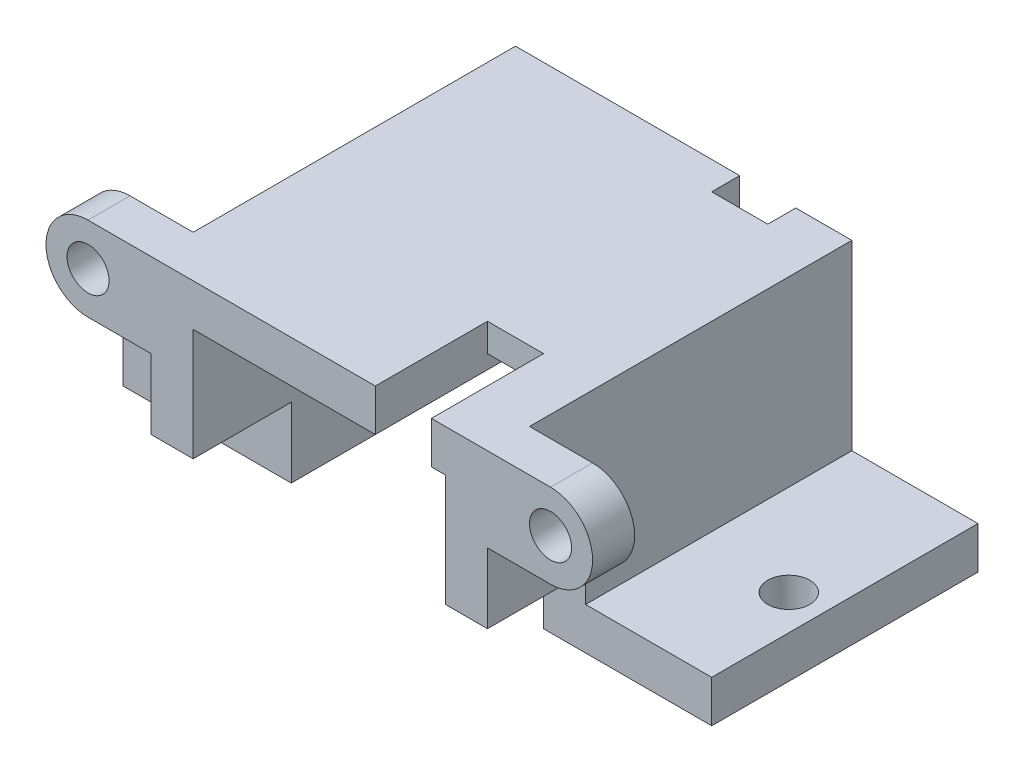
ISO-10303-21;
HEADER;
FILE_DESCRIPTION(('STEP AP214'),'2;1');
FILE_NAME('part.step','',(''),(''),'','','');
FILE_SCHEMA(('AUTOMOTIVE_DESIGN { 1 0 10303 214 1 1 1 1 }'));
ENDSEC;
DATA;
#1=APPLICATION_CONTEXT('core data for automotive mechanical design processes');
#2=APPLICATION_PROTOCOL_DEFINITION('international standard','automotive_design',2000,#1);
#3=PRODUCT_CONTEXT('',#1,'mechanical');
#4=PRODUCT('Part','Part','',(#3));
#5=PRODUCT_RELATED_PRODUCT_CATEGORY('part','',(#4));
#6=PRODUCT_DEFINITION_FORMATION('','',#4);
#7=PRODUCT_DEFINITION_CONTEXT('part definition',#1,'design');
#8=PRODUCT_DEFINITION('design','',#6,#7);
#9=PRODUCT_DEFINITION_SHAPE('','',#8);
#10=(LENGTH_UNIT() NAMED_UNIT(*) SI_UNIT(.MILLI.,.METRE.));
#11=(NAMED_UNIT(*) PLANE_ANGLE_UNIT() SI_UNIT($,.RADIAN.));
#12=(NAMED_UNIT(*) SI_UNIT($,.STERADIAN.) SOLID_ANGLE_UNIT());
#13=UNCERTAINTY_MEASURE_WITH_UNIT(LENGTH_MEASURE(1.E-05),#10,'distance_accuracy_value','');
#14=(GEOMETRIC_REPRESENTATION_CONTEXT(3) GLOBAL_UNCERTAINTY_ASSIGNED_CONTEXT((#13)) GLOBAL_UNIT_ASSIGNED_CONTEXT((#10,
#11,#12)) REPRESENTATION_CONTEXT('',''));
#15=CARTESIAN_POINT('',(0.,0.,0.));
#16=DIRECTION('',(0.,0.,1.));
#17=DIRECTION('',(1.,0.,0.));
#18=AXIS2_PLACEMENT_3D('',#15,#16,#17);
#19=CARTESIAN_POINT('',(-9.,13.,13.));
#20=DIRECTION('',(0.,1.,0.));
#21=DIRECTION('',(0.,0.,1.));
#22=AXIS2_PLACEMENT_3D('',#19,#20,#21);
#23=PLANE('',#22);
#24=DIRECTION('',(0.,0.,1.));
#25=VECTOR('',#24,1.);
#26=CARTESIAN_POINT('',(8.,13.,13.));
#27=LINE('',#26,#25);
#28=CARTESIAN_POINT('',(8.,13.,-13.));
#29=VERTEX_POINT('',#28);
#30=CARTESIAN_POINT('',(8.,13.,13.));
#31=VERTEX_POINT('',#30);
#32=EDGE_CURVE('E481',#29,#31,#27,.T.);
#33=ORIENTED_EDGE('',*,*,#32,.F.);
#34=DIRECTION('',(1.,0.,0.));
#35=VECTOR('',#34,1.);
#36=CARTESIAN_POINT('',(-9.,13.,-13.));
#37=LINE('',#36,#35);
#38=CARTESIAN_POINT('',(9.,13.,-13.));
#39=VERTEX_POINT('',#38);
#40=EDGE_CURVE('E373',#29,#39,#37,.T.);
#41=ORIENTED_EDGE('',*,*,#40,.T.);
#42=DIRECTION('',(0.,0.,-1.));
#43=VECTOR('',#42,1.);
#44=CARTESIAN_POINT('',(9.,13.,13.));
#45=LINE('',#44,#43);
#46=CARTESIAN_POINT('',(9.,13.,13.));
#47=VERTEX_POINT('',#46);
#48=EDGE_CURVE('E380',#47,#39,#45,.T.);
#49=ORIENTED_EDGE('',*,*,#48,.F.);
#50=DIRECTION('',(1.,0.,0.));
#51=VECTOR('',#50,1.);
#52=CARTESIAN_POINT('',(-9.,13.,13.));
#53=LINE('',#52,#51);
#54=EDGE_CURVE('E336',#31,#47,#53,.T.);
#55=ORIENTED_EDGE('',*,*,#54,.F.);
#56=EDGE_LOOP('',(#33,#41,#49,#55));
#57=FACE_BOUND('',#56,.T.);
#58=ADVANCED_FACE('F37',(#57),#23,.F.);
#59=CARTESIAN_POINT('',(-21.,3.,13.));
#60=DIRECTION('',(0.,1.,0.));
#61=DIRECTION('',(0.,0.,1.));
#62=AXIS2_PLACEMENT_3D('',#59,#60,#61);
#63=PLANE('',#62);
#64=DIRECTION('',(-1.,0.,0.));
#65=VECTOR('',#64,1.);
#66=CARTESIAN_POINT('',(-21.,3.,6.));
#67=LINE('',#66,#65);
#68=CARTESIAN_POINT('',(-12.,3.,6.));
#69=VERTEX_POINT('',#68);
#70=CARTESIAN_POINT('',(-21.,3.,6.));
#71=VERTEX_POINT('',#70);
#72=EDGE_CURVE('E455',#69,#71,#67,.T.);
#73=ORIENTED_EDGE('',*,*,#72,.F.);
#74=DIRECTION('',(0.,0.,-1.));
#75=VECTOR('',#74,1.);
#76=CARTESIAN_POINT('',(-12.,3.,13.));
#77=LINE('',#76,#75);
#78=CARTESIAN_POINT('',(-12.,3.,-13.));
#79=VERTEX_POINT('',#78);
#80=EDGE_CURVE('E392',#69,#79,#77,.T.);
#81=ORIENTED_EDGE('',*,*,#80,.T.);
#82=DIRECTION('',(1.,0.,0.));
#83=VECTOR('',#82,1.);
#84=CARTESIAN_POINT('',(-21.,3.,-13.));
#85=LINE('',#84,#83);
#86=CARTESIAN_POINT('',(-21.,3.,-13.));
#87=VERTEX_POINT('',#86);
#88=EDGE_CURVE('E362',#87,#79,#85,.T.);
#89=ORIENTED_EDGE('',*,*,#88,.F.);
#90=DIRECTION('',(0.,0.,-1.));
#91=VECTOR('',#90,1.);
#92=CARTESIAN_POINT('',(-21.,3.,13.));
#93=LINE('',#92,#91);
#94=EDGE_CURVE('E390',#71,#87,#93,.T.);
#95=ORIENTED_EDGE('',*,*,#94,.F.);
#96=EDGE_LOOP('',(#73,#81,#89,#95));
#97=FACE_BOUND('',#96,.T.);
#98=CARTESIAN_POINT('',(-18.5,3.,-2.));
#99=DIRECTION('',(0.,-1.,0.));
#100=DIRECTION('',(0.,0.,1.));
#101=AXIS2_PLACEMENT_3D('',#98,#99,#100);
#102=CIRCLE('',#101,1.5);
#103=CARTESIAN_POINT('',(-18.5,3.,-0.499999999999999));
#104=VERTEX_POINT('',#103);
#105=EDGE_CURVE('E567',#104,#104,#102,.T.);
#106=ORIENTED_EDGE('',*,*,#105,.T.);
#107=EDGE_LOOP('',(#106));
#108=FACE_BOUND('',#107,.T.);
#109=ADVANCED_FACE('F528',(#97,#108),#63,.T.);
#110=CARTESIAN_POINT('',(-21.,0.,13.));
#111=DIRECTION('',(0.,1.,0.));
#112=DIRECTION('',(0.,0.,1.));
#113=AXIS2_PLACEMENT_3D('',#110,#111,#112);
#114=PLANE('',#113);
#115=DIRECTION('',(0.,0.,-1.));
#116=VECTOR('',#115,1.);
#117=CARTESIAN_POINT('',(-9.,0.,13.));
#118=LINE('',#117,#116);
#119=CARTESIAN_POINT('',(-9.,0.,6.));
#120=VERTEX_POINT('',#119);
#121=CARTESIAN_POINT('',(-9.,0.,-13.));
#122=VERTEX_POINT('',#121);
#123=EDGE_CURVE('E386',#120,#122,#118,.T.);
#124=ORIENTED_EDGE('',*,*,#123,.F.);
#125=DIRECTION('',(1.,0.,0.));
#126=VECTOR('',#125,1.);
#127=CARTESIAN_POINT('',(-29.6023252670426,0.,6.));
#128=LINE('',#127,#126);
#129=CARTESIAN_POINT('',(-21.,0.,6.));
#130=VERTEX_POINT('',#129);
#131=EDGE_CURVE('E434',#130,#120,#128,.T.);
#132=ORIENTED_EDGE('',*,*,#131,.F.);
#133=DIRECTION('',(0.,0.,-1.));
#134=VECTOR('',#133,1.);
#135=CARTESIAN_POINT('',(-21.,0.,13.));
#136=LINE('',#135,#134);
#137=CARTESIAN_POINT('',(-21.,0.,-13.));
#138=VERTEX_POINT('',#137);
#139=EDGE_CURVE('E388',#130,#138,#136,.T.);
#140=ORIENTED_EDGE('',*,*,#139,.T.);
#141=DIRECTION('',(1.,0.,0.));
#142=VECTOR('',#141,1.);
#143=CARTESIAN_POINT('',(-21.,0.,-13.));
#144=LINE('',#143,#142);
#145=EDGE_CURVE('E368',#138,#122,#144,.T.);
#146=ORIENTED_EDGE('',*,*,#145,.T.);
#147=EDGE_LOOP('',(#124,#132,#140,#146));
#148=FACE_BOUND('',#147,.T.);
#149=CARTESIAN_POINT('',(-18.5,0.,-2.));
#150=DIRECTION('',(0.,1.,0.));
#151=DIRECTION('',(0.,0.,1.));
#152=AXIS2_PLACEMENT_3D('',#149,#150,#151);
#153=CIRCLE('',#152,1.5);
#154=CARTESIAN_POINT('',(-18.5,0.,-0.499999999999999));
#155=VERTEX_POINT('',#154);
#156=EDGE_CURVE('E564',#155,#155,#153,.T.);
#157=ORIENTED_EDGE('',*,*,#156,.T.);
#158=EDGE_LOOP('',(#157));
#159=FACE_BOUND('',#158,.T.);
#160=ADVANCED_FACE('F534',(#148,#159),#114,.F.);
#161=CARTESIAN_POINT('',(21.,0.,-13.));
#162=DIRECTION('',(0.,0.,-1.));
#163=DIRECTION('',(-1.,0.,0.));
#164=AXIS2_PLACEMENT_3D('',#161,#162,#163);
#165=PLANE('',#164);
#166=DIRECTION('',(0.,1.,0.));
#167=VECTOR('',#166,1.);
#168=CARTESIAN_POINT('',(4.,-0.001000000000001,-13.));
#169=LINE('',#168,#167);
#170=CARTESIAN_POINT('',(4.,13.,-13.));
#171=VERTEX_POINT('',#170);
#172=CARTESIAN_POINT('',(4.,16.,-13.));
#173=VERTEX_POINT('',#172);
#174=EDGE_CURVE('E472',#171,#173,#169,.T.);
#175=ORIENTED_EDGE('',*,*,#174,.F.);
#176=CARTESIAN_POINT('',(-9.,13.,-13.));
#177=VERTEX_POINT('',#176);
#178=EDGE_CURVE('E374',#177,#171,#37,.T.);
#179=ORIENTED_EDGE('',*,*,#178,.F.);
#180=DIRECTION('',(0.,1.,0.));
#181=VECTOR('',#180,1.);
#182=CARTESIAN_POINT('',(-9.,0.,-13.));
#183=LINE('',#182,#181);
#184=EDGE_CURVE('E371',#122,#177,#183,.T.);
#185=ORIENTED_EDGE('',*,*,#184,.F.);
#186=ORIENTED_EDGE('',*,*,#145,.F.);
#187=DIRECTION('',(0.,1.,0.));
#188=VECTOR('',#187,1.);
#189=CARTESIAN_POINT('',(-21.,0.,-13.));
#190=LINE('',#189,#188);
#191=EDGE_CURVE('E365',#138,#87,#190,.T.);
#192=ORIENTED_EDGE('',*,*,#191,.T.);
#193=ORIENTED_EDGE('',*,*,#88,.T.);
#194=DIRECTION('',(0.,1.,0.));
#195=VECTOR('',#194,1.);
#196=CARTESIAN_POINT('',(-12.,0.,-13.));
#197=LINE('',#196,#195);
#198=CARTESIAN_POINT('',(-12.,16.,-13.));
#199=VERTEX_POINT('',#198);
#200=EDGE_CURVE('E359',#79,#199,#197,.T.);
#201=ORIENTED_EDGE('',*,*,#200,.T.);
#202=DIRECTION('',(1.,0.,0.));
#203=VECTOR('',#202,1.);
#204=CARTESIAN_POINT('',(-9.,16.,-13.));
#205=LINE('',#204,#203);
#206=EDGE_CURVE('E356',#199,#173,#205,.T.);
#207=ORIENTED_EDGE('',*,*,#206,.T.);
#208=EDGE_LOOP('',(#175,#179,#185,#186,#192,#193,#201,#207));
#209=FACE_BOUND('',#208,.T.);
#210=ADVANCED_FACE('F553',(#209),#165,.T.);
#211=CARTESIAN_POINT('',(21.,0.,13.));
#212=DIRECTION('',(0.,0.,-1.));
#213=DIRECTION('',(-1.,0.,0.));
#214=AXIS2_PLACEMENT_3D('',#211,#212,#213);
#215=PLANE('',#214);
#216=CARTESIAN_POINT('',(16.5,13.,13.));
#217=DIRECTION('',(0.,0.,-1.));
#218=DIRECTION('',(-1.,0.,0.));
#219=AXIS2_PLACEMENT_3D('',#216,#217,#218);
#220=CIRCLE('',#219,1.5);
#221=CARTESIAN_POINT('',(15.,13.,13.));
#222=VERTEX_POINT('',#221);
#223=EDGE_CURVE('E261',#222,#222,#220,.T.);
#224=ORIENTED_EDGE('',*,*,#223,.T.);
#225=EDGE_LOOP('',(#224));
#226=FACE_BOUND('',#225,.T.);
#227=DIRECTION('',(0.,-1.,0.));
#228=VECTOR('',#227,1.);
#229=CARTESIAN_POINT('',(9.,13.,13.));
#230=LINE('',#229,#228);
#231=CARTESIAN_POINT('',(9.,5.,13.));
#232=VERTEX_POINT('',#231);
#233=EDGE_CURVE('E340',#47,#232,#230,.T.);
#234=ORIENTED_EDGE('',*,*,#233,.T.);
#235=DIRECTION('',(1.,0.,0.));
#236=VECTOR('',#235,1.);
#237=CARTESIAN_POINT('',(-29.6023252670426,5.,13.));
#238=LINE('',#237,#236);
#239=CARTESIAN_POINT('',(12.,5.,13.));
#240=VERTEX_POINT('',#239);
#241=EDGE_CURVE('E415',#232,#240,#238,.T.);
#242=ORIENTED_EDGE('',*,*,#241,.T.);
#243=DIRECTION('',(0.,-1.,0.));
#244=VECTOR('',#243,1.);
#245=CARTESIAN_POINT('',(12.,13.,13.));
#246=LINE('',#245,#244);
#247=CARTESIAN_POINT('',(12.,10.,13.));
#248=VERTEX_POINT('',#247);
#249=EDGE_CURVE('E324',#248,#240,#246,.T.);
#250=ORIENTED_EDGE('',*,*,#249,.F.);
#251=DIRECTION('',(-1.,0.,0.));
#252=VECTOR('',#251,1.);
#253=CARTESIAN_POINT('',(16.5,10.,13.));
#254=LINE('',#253,#252);
#255=CARTESIAN_POINT('',(16.5,10.,13.));
#256=VERTEX_POINT('',#255);
#257=EDGE_CURVE('E268',#256,#248,#254,.T.);
#258=ORIENTED_EDGE('',*,*,#257,.F.);
#259=CARTESIAN_POINT('',(16.5,13.,13.));
#260=DIRECTION('',(0.,0.,-1.));
#261=DIRECTION('',(1.,0.,0.));
#262=AXIS2_PLACEMENT_3D('',#259,#260,#261);
#263=CIRCLE('',#262,3.);
#264=CARTESIAN_POINT('',(16.5,16.,13.));
#265=VERTEX_POINT('',#264);
#266=EDGE_CURVE('E273',#265,#256,#263,.T.);
#267=ORIENTED_EDGE('',*,*,#266,.F.);
#268=DIRECTION('',(1.,0.,0.));
#269=VECTOR('',#268,1.);
#270=CARTESIAN_POINT('',(-9.,16.,13.));
#271=LINE('',#270,#269);
#272=CARTESIAN_POINT('',(8.,16.,13.));
#273=VERTEX_POINT('',#272);
#274=EDGE_CURVE('E327',#273,#265,#271,.T.);
#275=ORIENTED_EDGE('',*,*,#274,.F.);
#276=DIRECTION('',(0.,1.,0.));
#277=VECTOR('',#276,1.);
#278=CARTESIAN_POINT('',(8.,-0.001000000000001,13.));
#279=LINE('',#278,#277);
#280=EDGE_CURVE('E265',#31,#273,#279,.T.);
#281=ORIENTED_EDGE('',*,*,#280,.F.);
#282=ORIENTED_EDGE('',*,*,#54,.T.);
#283=EDGE_LOOP('',(#234,#242,#250,#258,#267,#275,#281,#282));
#284=FACE_BOUND('',#283,.T.);
#285=ADVANCED_FACE('F414',(#226,#284),#215,.F.);
#286=DIRECTION('',(0.,1.,0.));
#287=VECTOR('',#286,1.);
#288=CARTESIAN_POINT('',(-12.,0.,13.));
#289=LINE('',#288,#287);
#290=CARTESIAN_POINT('',(-12.,5.,13.));
#291=VERTEX_POINT('',#290);
#292=CARTESIAN_POINT('',(-12.,10.,13.));
#293=VERTEX_POINT('',#292);
#294=EDGE_CURVE('E332',#291,#293,#289,.T.);
#295=ORIENTED_EDGE('',*,*,#294,.F.);
#296=CARTESIAN_POINT('',(-9.,5.,13.));
#297=VERTEX_POINT('',#296);
#298=EDGE_CURVE('E448',#291,#297,#238,.T.);
#299=ORIENTED_EDGE('',*,*,#298,.T.);
#300=DIRECTION('',(0.,1.,0.));
#301=VECTOR('',#300,1.);
#302=CARTESIAN_POINT('',(-9.,0.,13.));
#303=LINE('',#302,#301);
#304=CARTESIAN_POINT('',(-9.,13.,13.));
#305=VERTEX_POINT('',#304);
#306=EDGE_CURVE('E334',#297,#305,#303,.T.);
#307=ORIENTED_EDGE('',*,*,#306,.T.);
#308=CARTESIAN_POINT('',(4.,13.,13.));
#309=VERTEX_POINT('',#308);
#310=EDGE_CURVE('E337',#305,#309,#53,.T.);
#311=ORIENTED_EDGE('',*,*,#310,.T.);
#312=DIRECTION('',(0.,1.,0.));
#313=VECTOR('',#312,1.);
#314=CARTESIAN_POINT('',(4.,-0.001000000000001,13.));
#315=LINE('',#314,#313);
#316=CARTESIAN_POINT('',(4.,16.,13.));
#317=VERTEX_POINT('',#316);
#318=EDGE_CURVE('E255',#309,#317,#315,.T.);
#319=ORIENTED_EDGE('',*,*,#318,.T.);
#320=CARTESIAN_POINT('',(-16.5,16.,13.));
#321=VERTEX_POINT('',#320);
#322=EDGE_CURVE('E329',#321,#317,#271,.T.);
#323=ORIENTED_EDGE('',*,*,#322,.F.);
#324=CARTESIAN_POINT('',(-16.5,13.,13.));
#325=DIRECTION('',(0.,0.,1.));
#326=DIRECTION('',(-1.,0.,0.));
#327=AXIS2_PLACEMENT_3D('',#324,#325,#326);
#328=CIRCLE('',#327,3.);
#329=CARTESIAN_POINT('',(-16.5,10.,13.));
#330=VERTEX_POINT('',#329);
#331=EDGE_CURVE('E296',#321,#330,#328,.T.);
#332=ORIENTED_EDGE('',*,*,#331,.T.);
#333=DIRECTION('',(1.,0.,0.));
#334=VECTOR('',#333,1.);
#335=CARTESIAN_POINT('',(-16.5,10.,13.));
#336=LINE('',#335,#334);
#337=EDGE_CURVE('E302',#330,#293,#336,.T.);
#338=ORIENTED_EDGE('',*,*,#337,.T.);
#339=EDGE_LOOP('',(#295,#299,#307,#311,#319,#323,#332,#338));
#340=FACE_BOUND('',#339,.T.);
#341=CARTESIAN_POINT('',(-16.5,13.,13.));
#342=DIRECTION('',(0.,0.,1.));
#343=DIRECTION('',(1.,0.,0.));
#344=AXIS2_PLACEMENT_3D('',#341,#342,#343);
#345=CIRCLE('',#344,1.5);
#346=CARTESIAN_POINT('',(-15.,13.,13.));
#347=VERTEX_POINT('',#346);
#348=EDGE_CURVE('E293',#347,#347,#345,.T.);
#349=ORIENTED_EDGE('',*,*,#348,.F.);
#350=EDGE_LOOP('',(#349));
#351=FACE_BOUND('',#350,.T.);
#352=ADVANCED_FACE('F488',(#340,#351),#215,.F.);
#353=CARTESIAN_POINT('',(16.5,13.,10.));
#354=DIRECTION('',(0.,0.,-1.));
#355=DIRECTION('',(1.,0.,0.));
#356=AXIS2_PLACEMENT_3D('',#353,#354,#355);
#357=PLANE('',#356);
#358=DIRECTION('',(0.,1.,0.));
#359=VECTOR('',#358,1.);
#360=CARTESIAN_POINT('',(12.,10.,10.));
#361=LINE('',#360,#359);
#362=CARTESIAN_POINT('',(12.,10.,10.));
#363=VERTEX_POINT('',#362);
#364=CARTESIAN_POINT('',(12.,16.,10.));
#365=VERTEX_POINT('',#364);
#366=EDGE_CURVE('E269',#363,#365,#361,.T.);
#367=ORIENTED_EDGE('',*,*,#366,.T.);
#368=DIRECTION('',(1.,0.,0.));
#369=VECTOR('',#368,1.);
#370=CARTESIAN_POINT('',(12.,16.,10.));
#371=LINE('',#370,#369);
#372=CARTESIAN_POINT('',(16.5,16.,10.));
#373=VERTEX_POINT('',#372);
#374=EDGE_CURVE('E278',#365,#373,#371,.T.);
#375=ORIENTED_EDGE('',*,*,#374,.T.);
#376=CARTESIAN_POINT('',(16.5,13.,10.));
#377=DIRECTION('',(0.,0.,-1.));
#378=DIRECTION('',(1.,0.,0.));
#379=AXIS2_PLACEMENT_3D('',#376,#377,#378);
#380=CIRCLE('',#379,3.);
#381=CARTESIAN_POINT('',(16.5,10.,10.));
#382=VERTEX_POINT('',#381);
#383=EDGE_CURVE('E276',#373,#382,#380,.T.);
#384=ORIENTED_EDGE('',*,*,#383,.T.);
#385=DIRECTION('',(-1.,0.,0.));
#386=VECTOR('',#385,1.);
#387=CARTESIAN_POINT('',(16.5,10.,10.));
#388=LINE('',#387,#386);
#389=EDGE_CURVE('E272',#382,#363,#388,.T.);
#390=ORIENTED_EDGE('',*,*,#389,.T.);
#391=EDGE_LOOP('',(#367,#375,#384,#390));
#392=FACE_BOUND('',#391,.T.);
#393=CARTESIAN_POINT('',(16.5,13.,10.));
#394=DIRECTION('',(0.,0.,-1.));
#395=DIRECTION('',(-1.,0.,0.));
#396=AXIS2_PLACEMENT_3D('',#393,#394,#395);
#397=CIRCLE('',#396,1.5);
#398=CARTESIAN_POINT('',(15.,13.,10.));
#399=VERTEX_POINT('',#398);
#400=EDGE_CURVE('E264',#399,#399,#397,.T.);
#401=ORIENTED_EDGE('',*,*,#400,.F.);
#402=EDGE_LOOP('',(#401));
#403=FACE_BOUND('',#402,.T.);
#404=ADVANCED_FACE('F598',(#392,#403),#357,.T.);
#405=CARTESIAN_POINT('',(12.,13.,13.));
#406=DIRECTION('',(1.,0.,0.));
#407=DIRECTION('',(0.,1.,0.));
#408=AXIS2_PLACEMENT_3D('',#405,#406,#407);
#409=PLANE('',#408);
#410=DIRECTION('',(0.,1.,0.));
#411=VECTOR('',#410,1.);
#412=CARTESIAN_POINT('',(12.,13.,6.));
#413=LINE('',#412,#411);
#414=CARTESIAN_POINT('',(12.,3.,6.));
#415=VERTEX_POINT('',#414);
#416=CARTESIAN_POINT('',(12.,5.,6.));
#417=VERTEX_POINT('',#416);
#418=EDGE_CURVE('E461',#415,#417,#413,.T.);
#419=ORIENTED_EDGE('',*,*,#418,.F.);
#420=DIRECTION('',(0.,0.,-1.));
#421=VECTOR('',#420,1.);
#422=CARTESIAN_POINT('',(12.,3.,13.));
#423=LINE('',#422,#421);
#424=CARTESIAN_POINT('',(12.,3.,-13.));
#425=VERTEX_POINT('',#424);
#426=EDGE_CURVE('E399',#415,#425,#423,.T.);
#427=ORIENTED_EDGE('',*,*,#426,.T.);
#428=DIRECTION('',(0.,-1.,0.));
#429=VECTOR('',#428,1.);
#430=CARTESIAN_POINT('',(12.,13.,-13.));
#431=LINE('',#430,#429);
#432=CARTESIAN_POINT('',(12.,16.,-13.));
#433=VERTEX_POINT('',#432);
#434=EDGE_CURVE('E352',#433,#425,#431,.T.);
#435=ORIENTED_EDGE('',*,*,#434,.F.);
#436=DIRECTION('',(0.,0.,-1.));
#437=VECTOR('',#436,1.);
#438=CARTESIAN_POINT('',(12.,16.,13.));
#439=LINE('',#438,#437);
#440=EDGE_CURVE('E396',#365,#433,#439,.T.);
#441=ORIENTED_EDGE('',*,*,#440,.F.);
#442=ORIENTED_EDGE('',*,*,#366,.F.);
#443=DIRECTION('',(0.,0.,1.));
#444=VECTOR('',#443,1.);
#445=CARTESIAN_POINT('',(12.,10.,10.));
#446=LINE('',#445,#444);
#447=EDGE_CURVE('E280',#363,#248,#446,.T.);
#448=ORIENTED_EDGE('',*,*,#447,.T.);
#449=ORIENTED_EDGE('',*,*,#249,.T.);
#450=DIRECTION('',(0.,0.,1.));
#451=VECTOR('',#450,1.);
#452=CARTESIAN_POINT('',(12.,5.,13.));
#453=LINE('',#452,#451);
#454=EDGE_CURVE('E450',#417,#240,#453,.T.);
#455=ORIENTED_EDGE('',*,*,#454,.F.);
#456=EDGE_LOOP('',(#419,#427,#435,#441,#442,#448,#449,#455));
#457=FACE_BOUND('',#456,.T.);
#458=ADVANCED_FACE('F583',(#457),#409,.T.);
#459=CARTESIAN_POINT('',(9.,0.,13.));
#460=DIRECTION('',(0.,1.,0.));
#461=DIRECTION('',(0.,0.,1.));
#462=AXIS2_PLACEMENT_3D('',#459,#460,#461);
#463=PLANE('',#462);
#464=CARTESIAN_POINT('',(18.5,0.,-2.));
#465=DIRECTION('',(0.,1.,0.));
#466=DIRECTION('',(0.,0.,1.));
#467=AXIS2_PLACEMENT_3D('',#464,#465,#466);
#468=CIRCLE('',#467,1.5);
#469=CARTESIAN_POINT('',(18.5,0.,-0.499999999999999));
#470=VERTEX_POINT('',#469);
#471=EDGE_CURVE('E438',#470,#470,#468,.F.);
#472=ORIENTED_EDGE('',*,*,#471,.F.);
#473=EDGE_LOOP('',(#472));
#474=FACE_BOUND('',#473,.T.);
#475=DIRECTION('',(0.,0.,-1.));
#476=VECTOR('',#475,1.);
#477=CARTESIAN_POINT('',(21.,0.,13.));
#478=LINE('',#477,#476);
#479=CARTESIAN_POINT('',(21.,0.,6.));
#480=VERTEX_POINT('',#479);
#481=CARTESIAN_POINT('',(21.,0.,-13.));
#482=VERTEX_POINT('',#481);
#483=EDGE_CURVE('E403',#480,#482,#478,.T.);
#484=ORIENTED_EDGE('',*,*,#483,.F.);
#485=CARTESIAN_POINT('',(9.,0.,6.));
#486=VERTEX_POINT('',#485);
#487=EDGE_CURVE('E431',#486,#480,#128,.T.);
#488=ORIENTED_EDGE('',*,*,#487,.F.);
#489=DIRECTION('',(0.,0.,-1.));
#490=VECTOR('',#489,1.);
#491=CARTESIAN_POINT('',(9.,0.,13.));
#492=LINE('',#491,#490);
#493=CARTESIAN_POINT('',(9.,0.,-13.));
#494=VERTEX_POINT('',#493);
#495=EDGE_CURVE('E343',#486,#494,#492,.T.);
#496=ORIENTED_EDGE('',*,*,#495,.T.);
#497=DIRECTION('',(1.,0.,0.));
#498=VECTOR('',#497,1.);
#499=CARTESIAN_POINT('',(9.,0.,-13.));
#500=LINE('',#499,#498);
#501=EDGE_CURVE('E319',#494,#482,#500,.T.);
#502=ORIENTED_EDGE('',*,*,#501,.T.);
#503=EDGE_LOOP('',(#484,#488,#496,#502));
#504=FACE_BOUND('',#503,.T.);
#505=ADVANCED_FACE('F39',(#474,#504),#463,.F.);
#506=CARTESIAN_POINT('',(21.,3.,13.));
#507=DIRECTION('',(1.,0.,0.));
#508=DIRECTION('',(0.,0.,-1.));
#509=AXIS2_PLACEMENT_3D('',#506,#507,#508);
#510=PLANE('',#509);
#511=DIRECTION('',(0.,1.,0.));
#512=VECTOR('',#511,1.);
#513=CARTESIAN_POINT('',(21.,0.,6.));
#514=LINE('',#513,#512);
#515=CARTESIAN_POINT('',(21.,3.,6.));
#516=VERTEX_POINT('',#515);
#517=EDGE_CURVE('E435',#480,#516,#514,.T.);
#518=ORIENTED_EDGE('',*,*,#517,.F.);
#519=ORIENTED_EDGE('',*,*,#483,.T.);
#520=DIRECTION('',(0.,-1.,0.));
#521=VECTOR('',#520,1.);
#522=CARTESIAN_POINT('',(21.,3.,-13.));
#523=LINE('',#522,#521);
#524=CARTESIAN_POINT('',(21.,3.,-13.));
#525=VERTEX_POINT('',#524);
#526=EDGE_CURVE('E346',#525,#482,#523,.T.);
#527=ORIENTED_EDGE('',*,*,#526,.F.);
#528=DIRECTION('',(0.,0.,-1.));
#529=VECTOR('',#528,1.);
#530=CARTESIAN_POINT('',(21.,3.,13.));
#531=LINE('',#530,#529);
#532=EDGE_CURVE('E401',#516,#525,#531,.T.);
#533=ORIENTED_EDGE('',*,*,#532,.F.);
#534=EDGE_LOOP('',(#518,#519,#527,#533));
#535=FACE_BOUND('',#534,.T.);
#536=ADVANCED_FACE('F607',(#535),#510,.T.);
#537=CARTESIAN_POINT('',(9.,3.,13.));
#538=DIRECTION('',(0.,1.,0.));
#539=DIRECTION('',(0.,0.,1.));
#540=AXIS2_PLACEMENT_3D('',#537,#538,#539);
#541=PLANE('',#540);
#542=CARTESIAN_POINT('',(18.5,3.,-2.));
#543=DIRECTION('',(0.,1.,0.));
#544=DIRECTION('',(0.,0.,1.));
#545=AXIS2_PLACEMENT_3D('',#542,#543,#544);
#546=CIRCLE('',#545,1.5);
#547=CARTESIAN_POINT('',(18.5,3.,-0.499999999999999));
#548=VERTEX_POINT('',#547);
#549=EDGE_CURVE('E570',#548,#548,#546,.T.);
#550=ORIENTED_EDGE('',*,*,#549,.F.);
#551=EDGE_LOOP('',(#550));
#552=FACE_BOUND('',#551,.T.);
#553=DIRECTION('',(-1.,0.,0.));
#554=VECTOR('',#553,1.);
#555=CARTESIAN_POINT('',(9.,3.,6.));
#556=LINE('',#555,#554);
#557=EDGE_CURVE('E459',#516,#415,#556,.T.);
#558=ORIENTED_EDGE('',*,*,#557,.F.);
#559=ORIENTED_EDGE('',*,*,#532,.T.);
#560=DIRECTION('',(1.,0.,0.));
#561=VECTOR('',#560,1.);
#562=CARTESIAN_POINT('',(9.,3.,-13.));
#563=LINE('',#562,#561);
#564=EDGE_CURVE('E349',#425,#525,#563,.T.);
#565=ORIENTED_EDGE('',*,*,#564,.F.);
#566=ORIENTED_EDGE('',*,*,#426,.F.);
#567=EDGE_LOOP('',(#558,#559,#565,#566));
#568=FACE_BOUND('',#567,.T.);
#569=ADVANCED_FACE('F604',(#552,#568),#541,.T.);
#570=CARTESIAN_POINT('',(-9.,16.,13.));
#571=DIRECTION('',(0.,1.,0.));
#572=DIRECTION('',(0.,0.,1.));
#573=AXIS2_PLACEMENT_3D('',#570,#571,#572);
#574=PLANE('',#573);
#575=DIRECTION('',(0.,0.,1.));
#576=VECTOR('',#575,1.);
#577=CARTESIAN_POINT('',(4.,16.,-13.));
#578=LINE('',#577,#576);
#579=CARTESIAN_POINT('',(4.,16.,-11.));
#580=VERTEX_POINT('',#579);
#581=EDGE_CURVE('E463',#173,#580,#578,.T.);
#582=ORIENTED_EDGE('',*,*,#581,.F.);
#583=ORIENTED_EDGE('',*,*,#206,.F.);
#584=DIRECTION('',(0.,0.,-1.));
#585=VECTOR('',#584,1.);
#586=CARTESIAN_POINT('',(-12.,16.,13.));
#587=LINE('',#586,#585);
#588=CARTESIAN_POINT('',(-12.,16.,10.));
#589=VERTEX_POINT('',#588);
#590=EDGE_CURVE('E394',#589,#199,#587,.T.);
#591=ORIENTED_EDGE('',*,*,#590,.F.);
#592=DIRECTION('',(-1.,0.,0.));
#593=VECTOR('',#592,1.);
#594=CARTESIAN_POINT('',(-12.,16.,10.));
#595=LINE('',#594,#593);
#596=CARTESIAN_POINT('',(-16.5,16.,10.));
#597=VERTEX_POINT('',#596);
#598=EDGE_CURVE('E301',#589,#597,#595,.T.);
#599=ORIENTED_EDGE('',*,*,#598,.T.);
#600=DIRECTION('',(0.,0.,1.));
#601=VECTOR('',#600,1.);
#602=CARTESIAN_POINT('',(-16.5,16.,10.));
#603=LINE('',#602,#601);
#604=EDGE_CURVE('E311',#597,#321,#603,.T.);
#605=ORIENTED_EDGE('',*,*,#604,.T.);
#606=ORIENTED_EDGE('',*,*,#322,.T.);
#607=DIRECTION('',(0.,0.,1.));
#608=VECTOR('',#607,1.);
#609=CARTESIAN_POINT('',(4.,16.,13.));
#610=LINE('',#609,#608);
#611=CARTESIAN_POINT('',(4.,16.,5.));
#612=VERTEX_POINT('',#611);
#613=EDGE_CURVE('E253',#612,#317,#610,.T.);
#614=ORIENTED_EDGE('',*,*,#613,.F.);
#615=DIRECTION('',(-1.,0.,0.));
#616=VECTOR('',#615,1.);
#617=CARTESIAN_POINT('',(8.,16.,5.));
#618=LINE('',#617,#616);
#619=CARTESIAN_POINT('',(8.,16.,5.));
#620=VERTEX_POINT('',#619);
#621=EDGE_CURVE('E257',#620,#612,#618,.T.);
#622=ORIENTED_EDGE('',*,*,#621,.F.);
#623=DIRECTION('',(0.,0.,-1.));
#624=VECTOR('',#623,1.);
#625=CARTESIAN_POINT('',(8.,16.,13.));
#626=LINE('',#625,#624);
#627=EDGE_CURVE('E251',#273,#620,#626,.T.);
#628=ORIENTED_EDGE('',*,*,#627,.F.);
#629=ORIENTED_EDGE('',*,*,#274,.T.);
#630=DIRECTION('',(0.,0.,1.));
#631=VECTOR('',#630,1.);
#632=CARTESIAN_POINT('',(16.5,16.,10.));
#633=LINE('',#632,#631);
#634=EDGE_CURVE('E284',#373,#265,#633,.T.);
#635=ORIENTED_EDGE('',*,*,#634,.F.);
#636=ORIENTED_EDGE('',*,*,#374,.F.);
#637=ORIENTED_EDGE('',*,*,#440,.T.);
#638=CARTESIAN_POINT('',(8.,16.,-13.));
#639=VERTEX_POINT('',#638);
#640=EDGE_CURVE('E355',#639,#433,#205,.T.);
#641=ORIENTED_EDGE('',*,*,#640,.F.);
#642=DIRECTION('',(0.,0.,-1.));
#643=VECTOR('',#642,1.);
#644=CARTESIAN_POINT('',(8.,16.,-13.));
#645=LINE('',#644,#643);
#646=CARTESIAN_POINT('',(8.,16.,-11.));
#647=VERTEX_POINT('',#646);
#648=EDGE_CURVE('E469',#647,#639,#645,.T.);
#649=ORIENTED_EDGE('',*,*,#648,.F.);
#650=DIRECTION('',(1.,0.,0.));
#651=VECTOR('',#650,1.);
#652=CARTESIAN_POINT('',(4.,16.,-11.));
#653=LINE('',#652,#651);
#654=EDGE_CURVE('E466',#580,#647,#653,.T.);
#655=ORIENTED_EDGE('',*,*,#654,.F.);
#656=EDGE_LOOP('',(#582,#583,#591,#599,#605,#606,#614,#622,#628,#629,#635,#636,#637,#641,#649,#655));
#657=FACE_BOUND('',#656,.T.);
#658=ADVANCED_FACE('F496',(#657),#574,.T.);
#659=CARTESIAN_POINT('',(-12.,0.,13.));
#660=DIRECTION('',(-1.,0.,0.));
#661=DIRECTION('',(0.,0.,1.));
#662=AXIS2_PLACEMENT_3D('',#659,#660,#661);
#663=PLANE('',#662);
#664=DIRECTION('',(0.,-1.,0.));
#665=VECTOR('',#664,1.);
#666=CARTESIAN_POINT('',(-12.,0.,6.));
#667=LINE('',#666,#665);
#668=CARTESIAN_POINT('',(-12.,5.,6.));
#669=VERTEX_POINT('',#668);
#670=EDGE_CURVE('E457',#669,#69,#667,.T.);
#671=ORIENTED_EDGE('',*,*,#670,.F.);
#672=DIRECTION('',(0.,0.,-1.));
#673=VECTOR('',#672,1.);
#674=CARTESIAN_POINT('',(-12.,5.,13.));
#675=LINE('',#674,#673);
#676=EDGE_CURVE('E447',#291,#669,#675,.T.);
#677=ORIENTED_EDGE('',*,*,#676,.F.);
#678=ORIENTED_EDGE('',*,*,#294,.T.);
#679=DIRECTION('',(0.,0.,1.));
#680=VECTOR('',#679,1.);
#681=CARTESIAN_POINT('',(-12.,10.,10.));
#682=LINE('',#681,#680);
#683=CARTESIAN_POINT('',(-12.,10.,10.));
#684=VERTEX_POINT('',#683);
#685=EDGE_CURVE('E316',#684,#293,#682,.T.);
#686=ORIENTED_EDGE('',*,*,#685,.F.);
#687=DIRECTION('',(0.,1.,0.));
#688=VECTOR('',#687,1.);
#689=CARTESIAN_POINT('',(-12.,10.,10.));
#690=LINE('',#689,#688);
#691=EDGE_CURVE('E299',#684,#589,#690,.T.);
#692=ORIENTED_EDGE('',*,*,#691,.T.);
#693=ORIENTED_EDGE('',*,*,#590,.T.);
#694=ORIENTED_EDGE('',*,*,#200,.F.);
#695=ORIENTED_EDGE('',*,*,#80,.F.);
#696=EDGE_LOOP('',(#671,#677,#678,#686,#692,#693,#694,#695));
#697=FACE_BOUND('',#696,.T.);
#698=ADVANCED_FACE('F510',(#697),#663,.T.);
#699=CARTESIAN_POINT('',(-21.,0.,13.));
#700=DIRECTION('',(-1.,0.,0.));
#701=DIRECTION('',(0.,0.,1.));
#702=AXIS2_PLACEMENT_3D('',#699,#700,#701);
#703=PLANE('',#702);
#704=DIRECTION('',(0.,1.,0.));
#705=VECTOR('',#704,1.);
#706=CARTESIAN_POINT('',(-21.,0.,6.));
#707=LINE('',#706,#705);
#708=EDGE_CURVE('E437',#130,#71,#707,.T.);
#709=ORIENTED_EDGE('',*,*,#708,.T.);
#710=ORIENTED_EDGE('',*,*,#94,.T.);
#711=ORIENTED_EDGE('',*,*,#191,.F.);
#712=ORIENTED_EDGE('',*,*,#139,.F.);
#713=EDGE_LOOP('',(#709,#710,#711,#712));
#714=FACE_BOUND('',#713,.T.);
#715=ADVANCED_FACE('F546',(#714),#703,.T.);
#716=CARTESIAN_POINT('',(-9.,0.,13.));
#717=DIRECTION('',(-1.,0.,0.));
#718=DIRECTION('',(0.,0.,1.));
#719=AXIS2_PLACEMENT_3D('',#716,#717,#718);
#720=PLANE('',#719);
#721=DIRECTION('',(0.,0.,-1.));
#722=VECTOR('',#721,1.);
#723=CARTESIAN_POINT('',(-9.,5.,13.));
#724=LINE('',#723,#722);
#725=CARTESIAN_POINT('',(-9.,5.,6.));
#726=VERTEX_POINT('',#725);
#727=EDGE_CURVE('E444',#297,#726,#724,.T.);
#728=ORIENTED_EDGE('',*,*,#727,.T.);
#729=DIRECTION('',(0.,-1.,0.));
#730=VECTOR('',#729,1.);
#731=CARTESIAN_POINT('',(-9.,0.,6.));
#732=LINE('',#731,#730);
#733=EDGE_CURVE('E452',#726,#120,#732,.T.);
#734=ORIENTED_EDGE('',*,*,#733,.T.);
#735=ORIENTED_EDGE('',*,*,#123,.T.);
#736=ORIENTED_EDGE('',*,*,#184,.T.);
#737=DIRECTION('',(0.,0.,-1.));
#738=VECTOR('',#737,1.);
#739=CARTESIAN_POINT('',(-9.,13.,13.));
#740=LINE('',#739,#738);
#741=EDGE_CURVE('E383',#305,#177,#740,.T.);
#742=ORIENTED_EDGE('',*,*,#741,.F.);
#743=ORIENTED_EDGE('',*,*,#306,.F.);
#744=EDGE_LOOP('',(#728,#734,#735,#736,#742,#743));
#745=FACE_BOUND('',#744,.T.);
#746=ADVANCED_FACE('F540',(#745),#720,.F.);
#747=ORIENTED_EDGE('',*,*,#178,.T.);
#748=DIRECTION('',(0.,0.,-1.));
#749=VECTOR('',#748,1.);
#750=CARTESIAN_POINT('',(4.,13.,13.));
#751=LINE('',#750,#749);
#752=EDGE_CURVE('E474',#309,#171,#751,.T.);
#753=ORIENTED_EDGE('',*,*,#752,.F.);
#754=ORIENTED_EDGE('',*,*,#310,.F.);
#755=ORIENTED_EDGE('',*,*,#741,.T.);
#756=EDGE_LOOP('',(#747,#753,#754,#755));
#757=FACE_BOUND('',#756,.T.);
#758=ADVANCED_FACE('F530',(#757),#23,.F.);
#759=CARTESIAN_POINT('',(9.,13.,13.));
#760=DIRECTION('',(1.,0.,0.));
#761=DIRECTION('',(0.,1.,0.));
#762=AXIS2_PLACEMENT_3D('',#759,#760,#761);
#763=PLANE('',#762);
#764=ORIENTED_EDGE('',*,*,#495,.F.);
#765=DIRECTION('',(0.,1.,0.));
#766=VECTOR('',#765,1.);
#767=CARTESIAN_POINT('',(9.,13.,6.));
#768=LINE('',#767,#766);
#769=CARTESIAN_POINT('',(9.,5.,6.));
#770=VERTEX_POINT('',#769);
#771=EDGE_CURVE('E11',#486,#770,#768,.T.);
#772=ORIENTED_EDGE('',*,*,#771,.T.);
#773=DIRECTION('',(0.,0.,1.));
#774=VECTOR('',#773,1.);
#775=CARTESIAN_POINT('',(9.,5.,13.));
#776=LINE('',#775,#774);
#777=EDGE_CURVE('E45',#770,#232,#776,.T.);
#778=ORIENTED_EDGE('',*,*,#777,.T.);
#779=ORIENTED_EDGE('',*,*,#233,.F.);
#780=ORIENTED_EDGE('',*,*,#48,.T.);
#781=DIRECTION('',(0.,-1.,0.));
#782=VECTOR('',#781,1.);
#783=CARTESIAN_POINT('',(9.,13.,-13.));
#784=LINE('',#783,#782);
#785=EDGE_CURVE('E328',#39,#494,#784,.T.);
#786=ORIENTED_EDGE('',*,*,#785,.T.);
#787=EDGE_LOOP('',(#764,#772,#778,#779,#780,#786));
#788=FACE_BOUND('',#787,.T.);
#789=ADVANCED_FACE('F408',(#788),#763,.F.);
#790=DIRECTION('',(0.,1.,0.));
#791=VECTOR('',#790,1.);
#792=CARTESIAN_POINT('',(8.,-0.001000000000001,-13.));
#793=LINE('',#792,#791);
#794=EDGE_CURVE('E475',#29,#639,#793,.T.);
#795=ORIENTED_EDGE('',*,*,#794,.T.);
#796=ORIENTED_EDGE('',*,*,#640,.T.);
#797=ORIENTED_EDGE('',*,*,#434,.T.);
#798=ORIENTED_EDGE('',*,*,#564,.T.);
#799=ORIENTED_EDGE('',*,*,#526,.T.);
#800=ORIENTED_EDGE('',*,*,#501,.F.);
#801=ORIENTED_EDGE('',*,*,#785,.F.);
#802=ORIENTED_EDGE('',*,*,#40,.F.);
#803=EDGE_LOOP('',(#795,#796,#797,#798,#799,#800,#801,#802));
#804=FACE_BOUND('',#803,.T.);
#805=ADVANCED_FACE('F426',(#804),#165,.T.);
#806=CARTESIAN_POINT('',(-16.5,10.,10.));
#807=DIRECTION('',(0.,-1.,0.));
#808=DIRECTION('',(0.,0.,-1.));
#809=AXIS2_PLACEMENT_3D('',#806,#807,#808);
#810=PLANE('',#809);
#811=ORIENTED_EDGE('',*,*,#337,.F.);
#812=DIRECTION('',(0.,0.,1.));
#813=VECTOR('',#812,1.);
#814=CARTESIAN_POINT('',(-16.5,10.,10.));
#815=LINE('',#814,#813);
#816=CARTESIAN_POINT('',(-16.5,10.,10.));
#817=VERTEX_POINT('',#816);
#818=EDGE_CURVE('E320',#817,#330,#815,.T.);
#819=ORIENTED_EDGE('',*,*,#818,.F.);
#820=DIRECTION('',(1.,0.,0.));
#821=VECTOR('',#820,1.);
#822=CARTESIAN_POINT('',(-16.5,10.,10.));
#823=LINE('',#822,#821);
#824=EDGE_CURVE('E308',#817,#684,#823,.T.);
#825=ORIENTED_EDGE('',*,*,#824,.T.);
#826=ORIENTED_EDGE('',*,*,#685,.T.);
#827=EDGE_LOOP('',(#811,#819,#825,#826));
#828=FACE_BOUND('',#827,.T.);
#829=ADVANCED_FACE('F505',(#828),#810,.T.);
#830=CARTESIAN_POINT('',(-16.5,13.,10.));
#831=DIRECTION('',(0.,0.,1.));
#832=DIRECTION('',(1.,0.,0.));
#833=AXIS2_PLACEMENT_3D('',#830,#831,#832);
#834=CYLINDRICAL_SURFACE('',#833,3.);
#835=ORIENTED_EDGE('',*,*,#331,.F.);
#836=ORIENTED_EDGE('',*,*,#604,.F.);
#837=CARTESIAN_POINT('',(-16.5,13.,10.));
#838=DIRECTION('',(0.,0.,1.));
#839=DIRECTION('',(-1.,0.,0.));
#840=AXIS2_PLACEMENT_3D('',#837,#838,#839);
#841=CIRCLE('',#840,3.);
#842=EDGE_CURVE('E305',#597,#817,#841,.T.);
#843=ORIENTED_EDGE('',*,*,#842,.T.);
#844=ORIENTED_EDGE('',*,*,#818,.T.);
#845=EDGE_LOOP('',(#835,#836,#843,#844));
#846=FACE_BOUND('',#845,.T.);
#847=ADVANCED_FACE('F502',(#846),#834,.T.);
#848=CARTESIAN_POINT('',(-16.5,13.,10.));
#849=DIRECTION('',(0.,0.,-1.));
#850=DIRECTION('',(-1.,0.,0.));
#851=AXIS2_PLACEMENT_3D('',#848,#849,#850);
#852=PLANE('',#851);
#853=CARTESIAN_POINT('',(-16.5,13.,10.));
#854=DIRECTION('',(0.,0.,-1.));
#855=DIRECTION('',(-1.,0.,0.));
#856=AXIS2_PLACEMENT_3D('',#853,#854,#855);
#857=CIRCLE('',#856,1.5);
#858=CARTESIAN_POINT('',(-18.,13.,10.));
#859=VERTEX_POINT('',#858);
#860=EDGE_CURVE('E287',#859,#859,#857,.F.);
#861=ORIENTED_EDGE('',*,*,#860,.T.);
#862=EDGE_LOOP('',(#861));
#863=FACE_BOUND('',#862,.T.);
#864=ORIENTED_EDGE('',*,*,#691,.F.);
#865=ORIENTED_EDGE('',*,*,#824,.F.);
#866=ORIENTED_EDGE('',*,*,#842,.F.);
#867=ORIENTED_EDGE('',*,*,#598,.F.);
#868=EDGE_LOOP('',(#864,#865,#866,#867));
#869=FACE_BOUND('',#868,.T.);
#870=ADVANCED_FACE('F513',(#863,#869),#852,.T.);
#871=CARTESIAN_POINT('',(-16.5,13.,-13.001));
#872=DIRECTION('',(0.,0.,1.));
#873=DIRECTION('',(1.,0.,0.));
#874=AXIS2_PLACEMENT_3D('',#871,#872,#873);
#875=CYLINDRICAL_SURFACE('',#874,1.5);
#876=ORIENTED_EDGE('',*,*,#860,.F.);
#877=EDGE_LOOP('',(#876));
#878=FACE_BOUND('',#877,.T.);
#879=ORIENTED_EDGE('',*,*,#348,.T.);
#880=EDGE_LOOP('',(#879));
#881=FACE_BOUND('',#880,.T.);
#882=ADVANCED_FACE('F515',(#878,#881),#875,.F.);
#883=CARTESIAN_POINT('',(16.5,13.,10.));
#884=DIRECTION('',(0.,0.,1.));
#885=DIRECTION('',(1.,0.,0.));
#886=AXIS2_PLACEMENT_3D('',#883,#884,#885);
#887=CYLINDRICAL_SURFACE('',#886,3.);
#888=ORIENTED_EDGE('',*,*,#266,.T.);
#889=DIRECTION('',(0.,0.,1.));
#890=VECTOR('',#889,1.);
#891=CARTESIAN_POINT('',(16.5,10.,10.));
#892=LINE('',#891,#890);
#893=EDGE_CURVE('E288',#382,#256,#892,.T.);
#894=ORIENTED_EDGE('',*,*,#893,.F.);
#895=ORIENTED_EDGE('',*,*,#383,.F.);
#896=ORIENTED_EDGE('',*,*,#634,.T.);
#897=EDGE_LOOP('',(#888,#894,#895,#896));
#898=FACE_BOUND('',#897,.T.);
#899=ADVANCED_FACE('F522',(#898),#887,.T.);
#900=CARTESIAN_POINT('',(16.5,10.,10.));
#901=DIRECTION('',(0.,1.,0.));
#902=DIRECTION('',(0.,0.,1.));
#903=AXIS2_PLACEMENT_3D('',#900,#901,#902);
#904=PLANE('',#903);
#905=ORIENTED_EDGE('',*,*,#257,.T.);
#906=ORIENTED_EDGE('',*,*,#447,.F.);
#907=ORIENTED_EDGE('',*,*,#389,.F.);
#908=ORIENTED_EDGE('',*,*,#893,.T.);
#909=EDGE_LOOP('',(#905,#906,#907,#908));
#910=FACE_BOUND('',#909,.T.);
#911=ADVANCED_FACE('F589',(#910),#904,.F.);
#912=CARTESIAN_POINT('',(16.5,13.,-13.001));
#913=DIRECTION('',(0.,0.,1.));
#914=DIRECTION('',(1.,0.,0.));
#915=AXIS2_PLACEMENT_3D('',#912,#913,#914);
#916=CYLINDRICAL_SURFACE('',#915,1.5);
#917=ORIENTED_EDGE('',*,*,#400,.T.);
#918=EDGE_LOOP('',(#917));
#919=FACE_BOUND('',#918,.T.);
#920=ORIENTED_EDGE('',*,*,#223,.F.);
#921=EDGE_LOOP('',(#920));
#922=FACE_BOUND('',#921,.T.);
#923=ADVANCED_FACE('F629',(#919,#922),#916,.F.);
#924=CARTESIAN_POINT('',(8.,-0.001000000000001,13.));
#925=DIRECTION('',(1.,0.,0.));
#926=DIRECTION('',(0.,0.,-1.));
#927=AXIS2_PLACEMENT_3D('',#924,#925,#926);
#928=PLANE('',#927);
#929=ORIENTED_EDGE('',*,*,#32,.T.);
#930=ORIENTED_EDGE('',*,*,#280,.T.);
#931=ORIENTED_EDGE('',*,*,#627,.T.);
#932=DIRECTION('',(0.,1.,0.));
#933=VECTOR('',#932,1.);
#934=CARTESIAN_POINT('',(8.,-0.001000000000001,5.));
#935=LINE('',#934,#933);
#936=CARTESIAN_POINT('',(8.,14.,5.));
#937=VERTEX_POINT('',#936);
#938=EDGE_CURVE('E245',#937,#620,#935,.T.);
#939=ORIENTED_EDGE('',*,*,#938,.F.);
#940=DIRECTION('',(0.,0.,1.));
#941=VECTOR('',#940,1.);
#942=CARTESIAN_POINT('',(8.,14.,5.));
#943=LINE('',#942,#941);
#944=CARTESIAN_POINT('',(8.,14.,-11.));
#945=VERTEX_POINT('',#944);
#946=EDGE_CURVE('E232',#945,#937,#943,.T.);
#947=ORIENTED_EDGE('',*,*,#946,.F.);
#948=DIRECTION('',(0.,1.,0.));
#949=VECTOR('',#948,1.);
#950=CARTESIAN_POINT('',(8.,-0.001000000000001,-11.));
#951=LINE('',#950,#949);
#952=EDGE_CURVE('E477',#945,#647,#951,.T.);
#953=ORIENTED_EDGE('',*,*,#952,.T.);
#954=ORIENTED_EDGE('',*,*,#648,.T.);
#955=ORIENTED_EDGE('',*,*,#794,.F.);
#956=EDGE_LOOP('',(#929,#930,#931,#939,#947,#953,#954,#955));
#957=FACE_BOUND('',#956,.T.);
#958=ADVANCED_FACE('F249',(#957),#928,.F.);
#959=CARTESIAN_POINT('',(4.,-0.001000000000001,13.));
#960=DIRECTION('',(-1.,0.,0.));
#961=DIRECTION('',(0.,0.,1.));
#962=AXIS2_PLACEMENT_3D('',#959,#960,#961);
#963=PLANE('',#962);
#964=ORIENTED_EDGE('',*,*,#752,.T.);
#965=ORIENTED_EDGE('',*,*,#174,.T.);
#966=ORIENTED_EDGE('',*,*,#581,.T.);
#967=DIRECTION('',(0.,1.,0.));
#968=VECTOR('',#967,1.);
#969=CARTESIAN_POINT('',(4.,-0.001000000000001,-11.));
#970=LINE('',#969,#968);
#971=CARTESIAN_POINT('',(4.,14.,-11.));
#972=VERTEX_POINT('',#971);
#973=EDGE_CURVE('E471',#972,#580,#970,.T.);
#974=ORIENTED_EDGE('',*,*,#973,.F.);
#975=DIRECTION('',(0.,0.,-1.));
#976=VECTOR('',#975,1.);
#977=CARTESIAN_POINT('',(4.,14.,5.));
#978=LINE('',#977,#976);
#979=CARTESIAN_POINT('',(4.,14.,5.));
#980=VERTEX_POINT('',#979);
#981=EDGE_CURVE('E52',#980,#972,#978,.T.);
#982=ORIENTED_EDGE('',*,*,#981,.F.);
#983=DIRECTION('',(0.,1.,0.));
#984=VECTOR('',#983,1.);
#985=CARTESIAN_POINT('',(4.,-0.001000000000001,5.));
#986=LINE('',#985,#984);
#987=EDGE_CURVE('E247',#980,#612,#986,.T.);
#988=ORIENTED_EDGE('',*,*,#987,.T.);
#989=ORIENTED_EDGE('',*,*,#613,.T.);
#990=ORIENTED_EDGE('',*,*,#318,.F.);
#991=EDGE_LOOP('',(#964,#965,#966,#974,#982,#988,#989,#990));
#992=FACE_BOUND('',#991,.T.);
#993=ADVANCED_FACE('F556',(#992),#963,.F.);
#994=CARTESIAN_POINT('',(8.,-0.001000000000001,5.));
#995=DIRECTION('',(0.,0.,-1.));
#996=DIRECTION('',(-1.,0.,0.));
#997=AXIS2_PLACEMENT_3D('',#994,#995,#996);
#998=PLANE('',#997);
#999=ORIENTED_EDGE('',*,*,#987,.F.);
#1000=DIRECTION('',(-1.,0.,0.));
#1001=VECTOR('',#1000,1.);
#1002=CARTESIAN_POINT('',(8.,14.,5.));
#1003=LINE('',#1002,#1001);
#1004=EDGE_CURVE('E235',#937,#980,#1003,.T.);
#1005=ORIENTED_EDGE('',*,*,#1004,.F.);
#1006=ORIENTED_EDGE('',*,*,#938,.T.);
#1007=ORIENTED_EDGE('',*,*,#621,.T.);
#1008=EDGE_LOOP('',(#999,#1005,#1006,#1007));
#1009=FACE_BOUND('',#1008,.T.);
#1010=ADVANCED_FACE('F243',(#1009),#998,.F.);
#1011=CARTESIAN_POINT('',(4.,-0.001000000000001,-11.));
#1012=DIRECTION('',(0.,0.,1.));
#1013=DIRECTION('',(1.,0.,0.));
#1014=AXIS2_PLACEMENT_3D('',#1011,#1012,#1013);
#1015=PLANE('',#1014);
#1016=ORIENTED_EDGE('',*,*,#952,.F.);
#1017=DIRECTION('',(1.,0.,0.));
#1018=VECTOR('',#1017,1.);
#1019=CARTESIAN_POINT('',(8.,14.,-11.));
#1020=LINE('',#1019,#1018);
#1021=EDGE_CURVE('E237',#972,#945,#1020,.T.);
#1022=ORIENTED_EDGE('',*,*,#1021,.F.);
#1023=ORIENTED_EDGE('',*,*,#973,.T.);
#1024=ORIENTED_EDGE('',*,*,#654,.T.);
#1025=EDGE_LOOP('',(#1016,#1022,#1023,#1024));
#1026=FACE_BOUND('',#1025,.T.);
#1027=ADVANCED_FACE('F562',(#1026),#1015,.F.);
#1028=CARTESIAN_POINT('',(-29.6023252670426,5.,13.));
#1029=DIRECTION('',(0.,1.,0.));
#1030=DIRECTION('',(0.,0.,1.));
#1031=AXIS2_PLACEMENT_3D('',#1028,#1029,#1030);
#1032=PLANE('',#1031);
#1033=ORIENTED_EDGE('',*,*,#454,.T.);
#1034=ORIENTED_EDGE('',*,*,#241,.F.);
#1035=ORIENTED_EDGE('',*,*,#777,.F.);
#1036=DIRECTION('',(1.,0.,0.));
#1037=VECTOR('',#1036,1.);
#1038=CARTESIAN_POINT('',(-29.6023252670426,5.,6.));
#1039=LINE('',#1038,#1037);
#1040=EDGE_CURVE('E442',#770,#417,#1039,.T.);
#1041=ORIENTED_EDGE('',*,*,#1040,.T.);
#1042=EDGE_LOOP('',(#1033,#1034,#1035,#1041));
#1043=FACE_BOUND('',#1042,.T.);
#1044=ADVANCED_FACE('F580',(#1043),#1032,.F.);
#1045=CARTESIAN_POINT('',(-29.6023252670426,0.,6.));
#1046=DIRECTION('',(0.,0.,-1.));
#1047=DIRECTION('',(-1.,0.,0.));
#1048=AXIS2_PLACEMENT_3D('',#1045,#1046,#1047);
#1049=PLANE('',#1048);
#1050=ORIENTED_EDGE('',*,*,#418,.T.);
#1051=ORIENTED_EDGE('',*,*,#1040,.F.);
#1052=ORIENTED_EDGE('',*,*,#771,.F.);
#1053=ORIENTED_EDGE('',*,*,#487,.T.);
#1054=ORIENTED_EDGE('',*,*,#517,.T.);
#1055=ORIENTED_EDGE('',*,*,#557,.T.);
#1056=EDGE_LOOP('',(#1050,#1051,#1052,#1053,#1054,#1055));
#1057=FACE_BOUND('',#1056,.T.);
#1058=ADVANCED_FACE('F608',(#1057),#1049,.F.);
#1059=ORIENTED_EDGE('',*,*,#670,.T.);
#1060=ORIENTED_EDGE('',*,*,#72,.T.);
#1061=ORIENTED_EDGE('',*,*,#708,.F.);
#1062=ORIENTED_EDGE('',*,*,#131,.T.);
#1063=ORIENTED_EDGE('',*,*,#733,.F.);
#1064=EDGE_CURVE('E60',#669,#726,#1039,.T.);
#1065=ORIENTED_EDGE('',*,*,#1064,.F.);
#1066=EDGE_LOOP('',(#1059,#1060,#1061,#1062,#1063,#1065));
#1067=FACE_BOUND('',#1066,.T.);
#1068=ADVANCED_FACE('F610',(#1067),#1049,.F.);
#1069=ORIENTED_EDGE('',*,*,#676,.T.);
#1070=ORIENTED_EDGE('',*,*,#1064,.T.);
#1071=ORIENTED_EDGE('',*,*,#727,.F.);
#1072=ORIENTED_EDGE('',*,*,#298,.F.);
#1073=EDGE_LOOP('',(#1069,#1070,#1071,#1072));
#1074=FACE_BOUND('',#1073,.T.);
#1075=ADVANCED_FACE('F616',(#1074),#1032,.F.);
#1076=CARTESIAN_POINT('',(18.5,-0.00100000000000013,-2.));
#1077=DIRECTION('',(0.,1.,0.));
#1078=DIRECTION('',(0.,0.,1.));
#1079=AXIS2_PLACEMENT_3D('',#1076,#1077,#1078);
#1080=CYLINDRICAL_SURFACE('',#1079,1.5);
#1081=ORIENTED_EDGE('',*,*,#549,.T.);
#1082=EDGE_LOOP('',(#1081));
#1083=FACE_BOUND('',#1082,.T.);
#1084=ORIENTED_EDGE('',*,*,#471,.T.);
#1085=EDGE_LOOP('',(#1084));
#1086=FACE_BOUND('',#1085,.T.);
#1087=ADVANCED_FACE('F691',(#1083,#1086),#1080,.F.);
#1088=CARTESIAN_POINT('',(-18.5,-0.00100000000000013,-2.));
#1089=DIRECTION('',(0.,1.,0.));
#1090=DIRECTION('',(0.,0.,1.));
#1091=AXIS2_PLACEMENT_3D('',#1088,#1089,#1090);
#1092=CYLINDRICAL_SURFACE('',#1091,1.5);
#1093=ORIENTED_EDGE('',*,*,#105,.F.);
#1094=EDGE_LOOP('',(#1093));
#1095=FACE_BOUND('',#1094,.T.);
#1096=ORIENTED_EDGE('',*,*,#156,.F.);
#1097=EDGE_LOOP('',(#1096));
#1098=FACE_BOUND('',#1097,.T.);
#1099=ADVANCED_FACE('F722',(#1095,#1098),#1092,.F.);
#1100=CARTESIAN_POINT('',(8.,14.,-11.));
#1101=DIRECTION('',(0.,1.,0.));
#1102=DIRECTION('',(0.,0.,1.));
#1103=AXIS2_PLACEMENT_3D('',#1100,#1101,#1102);
#1104=PLANE('',#1103);
#1105=ORIENTED_EDGE('',*,*,#946,.T.);
#1106=ORIENTED_EDGE('',*,*,#1004,.T.);
#1107=ORIENTED_EDGE('',*,*,#981,.T.);
#1108=ORIENTED_EDGE('',*,*,#1021,.T.);
#1109=EDGE_LOOP('',(#1105,#1106,#1107,#1108));
#1110=FACE_BOUND('',#1109,.T.);
#1111=ADVANCED_FACE('F234',(#1110),#1104,.F.);
#1112=CLOSED_SHELL('',(#58,#109,#160,#210,#285,#352,#404,#458,#505,#536,#569,#658,#698,#715,
#746,#758,#789,#805,#829,#847,#870,#882,#899,#911,#923,#958,#993,#1010,#1027,#1044,#1058,#1068,
#1075,#1087,#1099,#1111));
#1113=MANIFOLD_SOLID_BREP('B2',#1112);
#1114=ADVANCED_BREP_SHAPE_REPRESENTATION('',(#18,#1113),#14);
#1115=SHAPE_DEFINITION_REPRESENTATION(#9,#1114);
ENDSEC;
END-ISO-10303-21;
